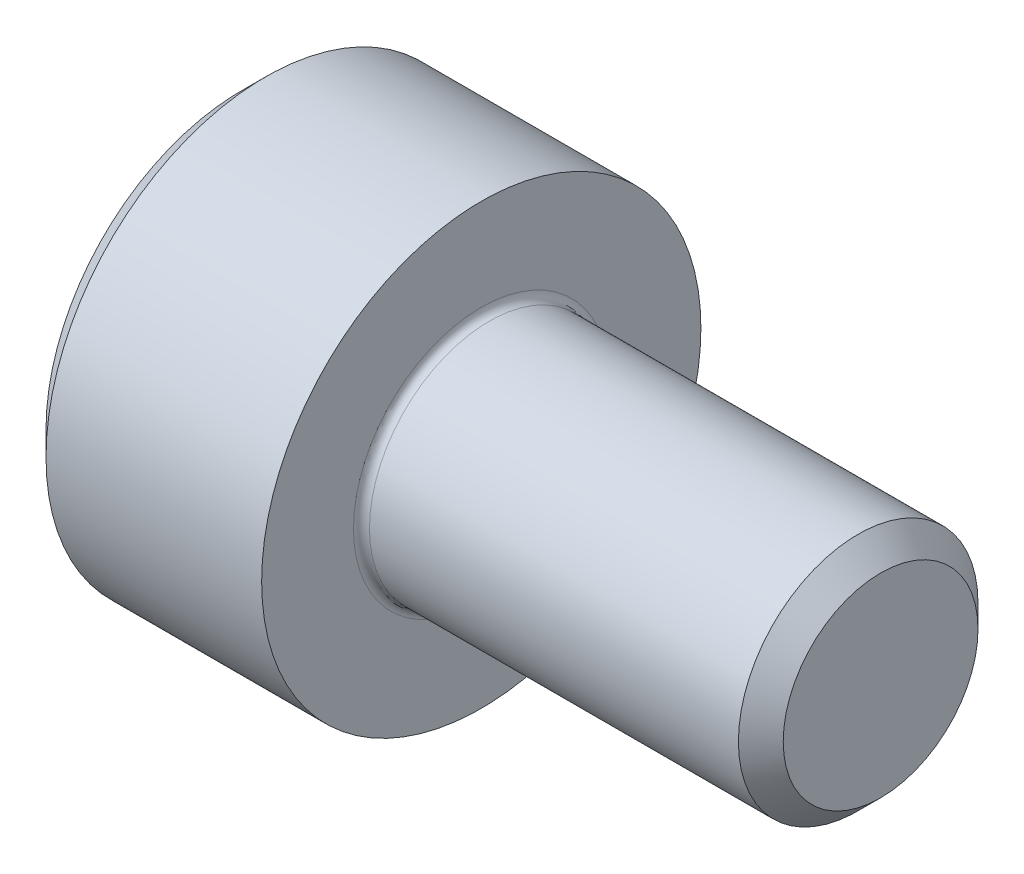
ISO-10303-21;
HEADER;
FILE_DESCRIPTION(('STEP AP214'),'2;1');
FILE_NAME('part.step','',(''),(''),'','','');
FILE_SCHEMA(('AUTOMOTIVE_DESIGN { 1 0 10303 214 1 1 1 1 }'));
ENDSEC;
DATA;
#1=APPLICATION_CONTEXT('core data for automotive mechanical design processes');
#2=APPLICATION_PROTOCOL_DEFINITION('international standard','automotive_design',2000,#1);
#3=PRODUCT_CONTEXT('',#1,'mechanical');
#4=PRODUCT('Part','Part','',(#3));
#5=PRODUCT_RELATED_PRODUCT_CATEGORY('part','',(#4));
#6=PRODUCT_DEFINITION_FORMATION('','',#4);
#7=PRODUCT_DEFINITION_CONTEXT('part definition',#1,'design');
#8=PRODUCT_DEFINITION('design','',#6,#7);
#9=PRODUCT_DEFINITION_SHAPE('','',#8);
#10=(LENGTH_UNIT() NAMED_UNIT(*) SI_UNIT(.MILLI.,.METRE.));
#11=(NAMED_UNIT(*) PLANE_ANGLE_UNIT() SI_UNIT($,.RADIAN.));
#12=(NAMED_UNIT(*) SI_UNIT($,.STERADIAN.) SOLID_ANGLE_UNIT());
#13=UNCERTAINTY_MEASURE_WITH_UNIT(LENGTH_MEASURE(1.E-05),#10,'distance_accuracy_value','');
#14=(GEOMETRIC_REPRESENTATION_CONTEXT(3) GLOBAL_UNCERTAINTY_ASSIGNED_CONTEXT((#13)) GLOBAL_UNIT_ASSIGNED_CONTEXT((#10,
#11,#12)) REPRESENTATION_CONTEXT('',''));
#15=CARTESIAN_POINT('',(0.,0.,0.));
#16=DIRECTION('',(0.,0.,1.));
#17=DIRECTION('',(1.,0.,0.));
#18=AXIS2_PLACEMENT_3D('',#15,#16,#17);
#19=CARTESIAN_POINT('',(0.,0.,0.));
#20=DIRECTION('',(-1.,0.,0.));
#21=DIRECTION('',(0.,0.,1.));
#22=AXIS2_PLACEMENT_3D('',#19,#20,#21);
#23=PLANE('',#22);
#24=DIRECTION('',(0.,-0.499999999999998,0.86602540378444));
#25=VECTOR('',#24,1.);
#26=CARTESIAN_POINT('',(0.,1.47801668912544,0.));
#27=LINE('',#26,#25);
#28=CARTESIAN_POINT('',(0.,1.47801668912544,0.));
#29=VERTEX_POINT('',#28);
#30=CARTESIAN_POINT('',(0.,0.73900834456272,1.28));
#31=VERTEX_POINT('',#30);
#32=EDGE_CURVE('E391',#29,#31,#27,.T.);
#33=ORIENTED_EDGE('',*,*,#32,.T.);
#34=DIRECTION('',(0.,1.,0.));
#35=VECTOR('',#34,1.);
#36=CARTESIAN_POINT('',(0.,-0.739008344562723,1.28));
#37=LINE('',#36,#35);
#38=CARTESIAN_POINT('',(0.,-0.739008344562723,1.28));
#39=VERTEX_POINT('',#38);
#40=EDGE_CURVE('E135',#39,#31,#37,.T.);
#41=ORIENTED_EDGE('',*,*,#40,.F.);
#42=DIRECTION('',(0.,-0.500000000000001,-0.866025403784438));
#43=VECTOR('',#42,1.);
#44=CARTESIAN_POINT('',(0.,-0.739008344562723,1.28));
#45=LINE('',#44,#43);
#46=CARTESIAN_POINT('',(0.,-1.47801668912545,0.));
#47=VERTEX_POINT('',#46);
#48=EDGE_CURVE('E394',#39,#47,#45,.T.);
#49=ORIENTED_EDGE('',*,*,#48,.T.);
#50=DIRECTION('',(0.,0.499999999999998,-0.866025403784439));
#51=VECTOR('',#50,1.);
#52=CARTESIAN_POINT('',(0.,-1.47801668912545,0.));
#53=LINE('',#52,#51);
#54=CARTESIAN_POINT('',(0.,-0.739008344562727,-1.28));
#55=VERTEX_POINT('',#54);
#56=EDGE_CURVE('E397',#47,#55,#53,.T.);
#57=ORIENTED_EDGE('',*,*,#56,.T.);
#58=DIRECTION('',(0.,-1.,0.));
#59=VECTOR('',#58,1.);
#60=CARTESIAN_POINT('',(0.,0.739008344562715,-1.28));
#61=LINE('',#60,#59);
#62=CARTESIAN_POINT('',(0.,0.739008344562715,-1.28));
#63=VERTEX_POINT('',#62);
#64=EDGE_CURVE('E400',#63,#55,#61,.T.);
#65=ORIENTED_EDGE('',*,*,#64,.F.);
#66=DIRECTION('',(0.,-0.500000000000001,-0.866025403784438));
#67=VECTOR('',#66,1.);
#68=CARTESIAN_POINT('',(0.,1.47801668912544,0.));
#69=LINE('',#68,#67);
#70=EDGE_CURVE('E130',#29,#63,#69,.T.);
#71=ORIENTED_EDGE('',*,*,#70,.F.);
#72=EDGE_LOOP('',(#33,#41,#49,#57,#65,#71));
#73=FACE_BOUND('',#72,.T.);
#74=CARTESIAN_POINT('',(0.,0.,0.));
#75=DIRECTION('',(-1.,0.,0.));
#76=DIRECTION('',(0.,0.,1.));
#77=AXIS2_PLACEMENT_3D('',#74,#75,#76);
#78=CIRCLE('',#77,2.45);
#79=CARTESIAN_POINT('',(0.,0.,2.45));
#80=VERTEX_POINT('',#79);
#81=EDGE_CURVE('E146',#80,#80,#78,.T.);
#82=ORIENTED_EDGE('',*,*,#81,.T.);
#83=EDGE_LOOP('',(#82));
#84=FACE_BOUND('',#83,.T.);
#85=ADVANCED_FACE('F39',(#73,#84),#23,.T.);
#86=CARTESIAN_POINT('',(8.,1.2195,0.));
#87=DIRECTION('',(1.,0.,0.));
#88=DIRECTION('',(0.,0.,-1.));
#89=AXIS2_PLACEMENT_3D('',#86,#87,#88);
#90=PLANE('',#89);
#91=CARTESIAN_POINT('',(8.,0.,0.));
#92=DIRECTION('',(-1.,0.,0.));
#93=DIRECTION('',(0.,0.,1.));
#94=AXIS2_PLACEMENT_3D('',#91,#92,#93);
#95=CIRCLE('',#94,1.2195);
#96=CARTESIAN_POINT('',(8.,0.,1.2195));
#97=VERTEX_POINT('',#96);
#98=EDGE_CURVE('E159',#97,#97,#95,.T.);
#99=ORIENTED_EDGE('',*,*,#98,.F.);
#100=EDGE_LOOP('',(#99));
#101=FACE_BOUND('',#100,.T.);
#102=ADVANCED_FACE('F180',(#101),#90,.T.);
#103=CARTESIAN_POINT('',(8.,0.,0.));
#104=DIRECTION('',(-1.,0.,0.));
#105=DIRECTION('',(0.,0.,1.));
#106=AXIS2_PLACEMENT_3D('',#103,#104,#105);
#107=CONICAL_SURFACE('',#106,1.2195,0.785398163397091);
#108=CARTESIAN_POINT('',(7.71949999999991,0.,0.));
#109=DIRECTION('',(-1.,0.,0.));
#110=DIRECTION('',(0.,0.,1.));
#111=AXIS2_PLACEMENT_3D('',#108,#109,#110);
#112=CIRCLE('',#111,1.49999999999989);
#113=CARTESIAN_POINT('',(7.71949999999991,0.,1.49999999999989));
#114=VERTEX_POINT('',#113);
#115=EDGE_CURVE('E156',#114,#114,#112,.T.);
#116=ORIENTED_EDGE('',*,*,#115,.F.);
#117=EDGE_LOOP('',(#116));
#118=FACE_BOUND('',#117,.T.);
#119=ORIENTED_EDGE('',*,*,#98,.T.);
#120=EDGE_LOOP('',(#119));
#121=FACE_BOUND('',#120,.T.);
#122=ADVANCED_FACE('F186',(#118,#121),#107,.T.);
#123=CARTESIAN_POINT('',(-31.75,0.,0.));
#124=DIRECTION('',(-1.,0.,0.));
#125=DIRECTION('',(0.,0.,1.));
#126=AXIS2_PLACEMENT_3D('',#123,#124,#125);
#127=CYLINDRICAL_SURFACE('',#126,1.49999999999995);
#128=CARTESIAN_POINT('',(3.1,0.,0.));
#129=DIRECTION('',(1.,0.,0.));
#130=DIRECTION('',(0.,0.,-1.));
#131=AXIS2_PLACEMENT_3D('',#128,#129,#130);
#132=CIRCLE('',#131,1.49999999999995);
#133=CARTESIAN_POINT('',(3.1,0.,-1.49999999999995));
#134=VERTEX_POINT('',#133);
#135=EDGE_CURVE('E11',#134,#134,#132,.T.);
#136=ORIENTED_EDGE('',*,*,#135,.T.);
#137=EDGE_LOOP('',(#136));
#138=FACE_BOUND('',#137,.T.);
#139=ORIENTED_EDGE('',*,*,#115,.T.);
#140=EDGE_LOOP('',(#139));
#141=FACE_BOUND('',#140,.T.);
#142=ADVANCED_FACE('F197',(#138,#141),#127,.T.);
#143=CARTESIAN_POINT('',(3.,2.75,0.));
#144=DIRECTION('',(1.,0.,0.));
#145=DIRECTION('',(0.,0.,-1.));
#146=AXIS2_PLACEMENT_3D('',#143,#144,#145);
#147=PLANE('',#146);
#148=CARTESIAN_POINT('',(3.,0.,0.));
#149=DIRECTION('',(1.,0.,0.));
#150=DIRECTION('',(0.,0.,-1.));
#151=AXIS2_PLACEMENT_3D('',#148,#149,#150);
#152=CIRCLE('',#151,1.59999999999995);
#153=CARTESIAN_POINT('',(3.,0.,-1.59999999999995));
#154=VERTEX_POINT('',#153);
#155=EDGE_CURVE('E47',#154,#154,#152,.F.);
#156=ORIENTED_EDGE('',*,*,#155,.T.);
#157=EDGE_LOOP('',(#156));
#158=FACE_BOUND('',#157,.T.);
#159=CARTESIAN_POINT('',(3.,0.,0.));
#160=DIRECTION('',(-1.,0.,0.));
#161=DIRECTION('',(0.,0.,1.));
#162=AXIS2_PLACEMENT_3D('',#159,#160,#161);
#163=CIRCLE('',#162,2.75);
#164=CARTESIAN_POINT('',(3.,0.,2.75));
#165=VERTEX_POINT('',#164);
#166=EDGE_CURVE('E153',#165,#165,#163,.T.);
#167=ORIENTED_EDGE('',*,*,#166,.F.);
#168=EDGE_LOOP('',(#167));
#169=FACE_BOUND('',#168,.T.);
#170=ADVANCED_FACE('F164',(#158,#169),#147,.T.);
#171=CARTESIAN_POINT('',(-31.75,0.,0.));
#172=DIRECTION('',(-1.,0.,0.));
#173=DIRECTION('',(0.,0.,1.));
#174=AXIS2_PLACEMENT_3D('',#171,#172,#173);
#175=CYLINDRICAL_SURFACE('',#174,2.75);
#176=ORIENTED_EDGE('',*,*,#166,.T.);
#177=EDGE_LOOP('',(#176));
#178=FACE_BOUND('',#177,.T.);
#179=CARTESIAN_POINT('',(0.300000000000002,0.,0.));
#180=DIRECTION('',(-1.,0.,0.));
#181=DIRECTION('',(0.,0.,1.));
#182=AXIS2_PLACEMENT_3D('',#179,#180,#181);
#183=CIRCLE('',#182,2.75);
#184=CARTESIAN_POINT('',(0.300000000000002,0.,2.75));
#185=VERTEX_POINT('',#184);
#186=EDGE_CURVE('E150',#185,#185,#183,.T.);
#187=ORIENTED_EDGE('',*,*,#186,.F.);
#188=EDGE_LOOP('',(#187));
#189=FACE_BOUND('',#188,.T.);
#190=ADVANCED_FACE('F175',(#178,#189),#175,.T.);
#191=CARTESIAN_POINT('',(0.,0.,0.));
#192=DIRECTION('',(1.,0.,0.));
#193=DIRECTION('',(0.,0.,-1.));
#194=AXIS2_PLACEMENT_3D('',#191,#192,#193);
#195=CONICAL_SURFACE('',#194,2.45,0.785398163397441);
#196=ORIENTED_EDGE('',*,*,#186,.T.);
#197=EDGE_LOOP('',(#196));
#198=FACE_BOUND('',#197,.T.);
#199=ORIENTED_EDGE('',*,*,#81,.F.);
#200=EDGE_LOOP('',(#199));
#201=FACE_BOUND('',#200,.T.);
#202=ADVANCED_FACE('F168',(#198,#201),#195,.T.);
#203=CARTESIAN_POINT('',(3.1,0.,0.));
#204=DIRECTION('',(1.,0.,0.));
#205=DIRECTION('',(0.,0.,-1.));
#206=AXIS2_PLACEMENT_3D('',#203,#204,#205);
#207=TOROIDAL_SURFACE('',#206,1.59999999999995,0.1);
#208=ORIENTED_EDGE('',*,*,#135,.F.);
#209=EDGE_LOOP('',(#208));
#210=FACE_BOUND('',#209,.T.);
#211=ORIENTED_EDGE('',*,*,#155,.F.);
#212=EDGE_LOOP('',(#211));
#213=FACE_BOUND('',#212,.T.);
#214=ADVANCED_FACE('F41',(#210,#213),#207,.F.);
#215=CARTESIAN_POINT('',(1.3,1.47801668912544,0.));
#216=DIRECTION('',(0.,-0.86602540378444,-0.499999999999998));
#217=DIRECTION('',(0.,0.499999999999998,-0.86602540378444));
#218=AXIS2_PLACEMENT_3D('',#215,#216,#217);
#219=PLANE('',#218);
#220=ORIENTED_EDGE('',*,*,#32,.F.);
#221=DIRECTION('',(-1.,0.,0.));
#222=VECTOR('',#221,1.);
#223=CARTESIAN_POINT('',(1.3,1.47801668912544,0.));
#224=LINE('',#223,#222);
#225=CARTESIAN_POINT('',(1.3,1.47801668912544,0.));
#226=VERTEX_POINT('',#225);
#227=EDGE_CURVE('E381',#226,#29,#224,.T.);
#228=ORIENTED_EDGE('',*,*,#227,.F.);
#229=DIRECTION('',(0.,-0.499999999999998,0.86602540378444));
#230=VECTOR('',#229,1.);
#231=CARTESIAN_POINT('',(1.3,1.47801668912544,0.));
#232=LINE('',#231,#230);
#233=CARTESIAN_POINT('',(1.3,1.10851251684408,0.639999999999996));
#234=VERTEX_POINT('',#233);
#235=EDGE_CURVE('E122',#226,#234,#232,.T.);
#236=ORIENTED_EDGE('',*,*,#235,.T.);
#237=CARTESIAN_POINT('',(1.3,0.73900834456272,1.28));
#238=VERTEX_POINT('',#237);
#239=EDGE_CURVE('E113',#234,#238,#232,.T.);
#240=ORIENTED_EDGE('',*,*,#239,.T.);
#241=DIRECTION('',(-1.,0.,0.));
#242=VECTOR('',#241,1.);
#243=CARTESIAN_POINT('',(1.3,0.73900834456272,1.28));
#244=LINE('',#243,#242);
#245=EDGE_CURVE('E127',#238,#31,#244,.T.);
#246=ORIENTED_EDGE('',*,*,#245,.T.);
#247=EDGE_LOOP('',(#220,#228,#236,#240,#246));
#248=FACE_BOUND('',#247,.T.);
#249=ADVANCED_FACE('F126',(#248),#219,.T.);
#250=CARTESIAN_POINT('',(1.3,-0.739008344562723,1.28));
#251=DIRECTION('',(0.,0.,1.));
#252=DIRECTION('',(0.,-1.,0.));
#253=AXIS2_PLACEMENT_3D('',#250,#251,#252);
#254=PLANE('',#253);
#255=ORIENTED_EDGE('',*,*,#40,.T.);
#256=ORIENTED_EDGE('',*,*,#245,.F.);
#257=DIRECTION('',(0.,1.,0.));
#258=VECTOR('',#257,1.);
#259=CARTESIAN_POINT('',(1.3,-0.739008344562723,1.28));
#260=LINE('',#259,#258);
#261=CARTESIAN_POINT('',(1.3,0.,1.28));
#262=VERTEX_POINT('',#261);
#263=EDGE_CURVE('E110',#262,#238,#260,.T.);
#264=ORIENTED_EDGE('',*,*,#263,.F.);
#265=CARTESIAN_POINT('',(1.3,-0.739008344562723,1.28));
#266=VERTEX_POINT('',#265);
#267=EDGE_CURVE('E121',#266,#262,#260,.T.);
#268=ORIENTED_EDGE('',*,*,#267,.F.);
#269=DIRECTION('',(-1.,0.,0.));
#270=VECTOR('',#269,1.);
#271=CARTESIAN_POINT('',(1.3,-0.739008344562723,1.28));
#272=LINE('',#271,#270);
#273=EDGE_CURVE('E137',#266,#39,#272,.T.);
#274=ORIENTED_EDGE('',*,*,#273,.T.);
#275=EDGE_LOOP('',(#255,#256,#264,#268,#274));
#276=FACE_BOUND('',#275,.T.);
#277=ADVANCED_FACE('F132',(#276),#254,.F.);
#278=CARTESIAN_POINT('',(1.3,-0.739008344562723,1.28));
#279=DIRECTION('',(0.,0.866025403784438,-0.500000000000001));
#280=DIRECTION('',(0.,0.500000000000001,0.866025403784438));
#281=AXIS2_PLACEMENT_3D('',#278,#279,#280);
#282=PLANE('',#281);
#283=ORIENTED_EDGE('',*,*,#48,.F.);
#284=ORIENTED_EDGE('',*,*,#273,.F.);
#285=DIRECTION('',(0.,-0.500000000000001,-0.866025403784438));
#286=VECTOR('',#285,1.);
#287=CARTESIAN_POINT('',(1.3,-0.739008344562723,1.28));
#288=LINE('',#287,#286);
#289=CARTESIAN_POINT('',(1.3,-1.10851251684408,0.640000000000003));
#290=VERTEX_POINT('',#289);
#291=EDGE_CURVE('E420',#266,#290,#288,.T.);
#292=ORIENTED_EDGE('',*,*,#291,.T.);
#293=CARTESIAN_POINT('',(1.3,-1.47801668912545,0.));
#294=VERTEX_POINT('',#293);
#295=EDGE_CURVE('E409',#290,#294,#288,.T.);
#296=ORIENTED_EDGE('',*,*,#295,.T.);
#297=DIRECTION('',(-1.,0.,0.));
#298=VECTOR('',#297,1.);
#299=CARTESIAN_POINT('',(1.3,-1.47801668912545,0.));
#300=LINE('',#299,#298);
#301=EDGE_CURVE('E142',#294,#47,#300,.T.);
#302=ORIENTED_EDGE('',*,*,#301,.T.);
#303=EDGE_LOOP('',(#283,#284,#292,#296,#302));
#304=FACE_BOUND('',#303,.T.);
#305=ADVANCED_FACE('F272',(#304),#282,.T.);
#306=CARTESIAN_POINT('',(1.3,-1.47801668912545,0.));
#307=DIRECTION('',(0.,0.86602540378444,0.499999999999998));
#308=DIRECTION('',(0.,-0.499999999999998,0.86602540378444));
#309=AXIS2_PLACEMENT_3D('',#306,#307,#308);
#310=PLANE('',#309);
#311=ORIENTED_EDGE('',*,*,#56,.F.);
#312=ORIENTED_EDGE('',*,*,#301,.F.);
#313=DIRECTION('',(0.,0.499999999999998,-0.866025403784439));
#314=VECTOR('',#313,1.);
#315=CARTESIAN_POINT('',(1.3,-1.47801668912545,0.));
#316=LINE('',#315,#314);
#317=CARTESIAN_POINT('',(1.3,-1.10851251684409,-0.64));
#318=VERTEX_POINT('',#317);
#319=EDGE_CURVE('E387',#294,#318,#316,.T.);
#320=ORIENTED_EDGE('',*,*,#319,.T.);
#321=CARTESIAN_POINT('',(1.3,-0.739008344562727,-1.28));
#322=VERTEX_POINT('',#321);
#323=EDGE_CURVE('E419',#318,#322,#316,.T.);
#324=ORIENTED_EDGE('',*,*,#323,.T.);
#325=DIRECTION('',(-1.,0.,0.));
#326=VECTOR('',#325,1.);
#327=CARTESIAN_POINT('',(1.3,-0.739008344562727,-1.28));
#328=LINE('',#327,#326);
#329=EDGE_CURVE('E380',#322,#55,#328,.T.);
#330=ORIENTED_EDGE('',*,*,#329,.T.);
#331=EDGE_LOOP('',(#311,#312,#320,#324,#330));
#332=FACE_BOUND('',#331,.T.);
#333=ADVANCED_FACE('F280',(#332),#310,.T.);
#334=CARTESIAN_POINT('',(1.3,0.739008344562715,-1.28));
#335=DIRECTION('',(0.,0.,-1.));
#336=DIRECTION('',(0.,1.,0.));
#337=AXIS2_PLACEMENT_3D('',#334,#335,#336);
#338=PLANE('',#337);
#339=ORIENTED_EDGE('',*,*,#64,.T.);
#340=ORIENTED_EDGE('',*,*,#329,.F.);
#341=DIRECTION('',(0.,-1.,0.));
#342=VECTOR('',#341,1.);
#343=CARTESIAN_POINT('',(1.3,0.739008344562715,-1.28));
#344=LINE('',#343,#342);
#345=CARTESIAN_POINT('',(1.3,0.,-1.28));
#346=VERTEX_POINT('',#345);
#347=EDGE_CURVE('E384',#346,#322,#344,.T.);
#348=ORIENTED_EDGE('',*,*,#347,.F.);
#349=CARTESIAN_POINT('',(1.3,0.739008344562715,-1.28));
#350=VERTEX_POINT('',#349);
#351=EDGE_CURVE('E54',#350,#346,#344,.T.);
#352=ORIENTED_EDGE('',*,*,#351,.F.);
#353=DIRECTION('',(-1.,0.,0.));
#354=VECTOR('',#353,1.);
#355=CARTESIAN_POINT('',(1.3,0.739008344562715,-1.28));
#356=LINE('',#355,#354);
#357=EDGE_CURVE('E377',#350,#63,#356,.T.);
#358=ORIENTED_EDGE('',*,*,#357,.T.);
#359=EDGE_LOOP('',(#339,#340,#348,#352,#358));
#360=FACE_BOUND('',#359,.T.);
#361=ADVANCED_FACE('F289',(#360),#338,.F.);
#362=CARTESIAN_POINT('',(1.3,1.47801668912544,0.));
#363=DIRECTION('',(0.,0.866025403784438,-0.500000000000001));
#364=DIRECTION('',(0.,0.500000000000001,0.866025403784438));
#365=AXIS2_PLACEMENT_3D('',#362,#363,#364);
#366=PLANE('',#365);
#367=ORIENTED_EDGE('',*,*,#70,.T.);
#368=ORIENTED_EDGE('',*,*,#357,.F.);
#369=DIRECTION('',(0.,-0.500000000000001,-0.866025403784438));
#370=VECTOR('',#369,1.);
#371=CARTESIAN_POINT('',(1.3,1.47801668912544,0.));
#372=LINE('',#371,#370);
#373=CARTESIAN_POINT('',(1.3,1.10851251684408,-0.64));
#374=VERTEX_POINT('',#373);
#375=EDGE_CURVE('E367',#374,#350,#372,.T.);
#376=ORIENTED_EDGE('',*,*,#375,.F.);
#377=EDGE_CURVE('E373',#226,#374,#372,.T.);
#378=ORIENTED_EDGE('',*,*,#377,.F.);
#379=ORIENTED_EDGE('',*,*,#227,.T.);
#380=EDGE_LOOP('',(#367,#368,#376,#378,#379));
#381=FACE_BOUND('',#380,.T.);
#382=ADVANCED_FACE('F298',(#381),#366,.F.);
#383=CARTESIAN_POINT('',(1.3,2.21702503368816,-1.28000000000001));
#384=DIRECTION('',(1.,0.,0.));
#385=DIRECTION('',(0.,0.,-1.));
#386=AXIS2_PLACEMENT_3D('',#383,#384,#385);
#387=PLANE('',#386);
#388=ORIENTED_EDGE('',*,*,#347,.T.);
#389=ORIENTED_EDGE('',*,*,#323,.F.);
#390=CARTESIAN_POINT('',(1.3,0.,0.));
#391=DIRECTION('',(-1.,0.,0.));
#392=DIRECTION('',(0.,0.,1.));
#393=AXIS2_PLACEMENT_3D('',#390,#391,#392);
#394=CIRCLE('',#393,1.28);
#395=EDGE_CURVE('E415',#346,#318,#394,.T.);
#396=ORIENTED_EDGE('',*,*,#395,.F.);
#397=EDGE_LOOP('',(#388,#389,#396));
#398=FACE_BOUND('',#397,.T.);
#399=ADVANCED_FACE('F307',(#398),#387,.F.);
#400=ORIENTED_EDGE('',*,*,#319,.F.);
#401=ORIENTED_EDGE('',*,*,#295,.F.);
#402=EDGE_CURVE('E140',#318,#290,#394,.T.);
#403=ORIENTED_EDGE('',*,*,#402,.F.);
#404=EDGE_LOOP('',(#400,#401,#403));
#405=FACE_BOUND('',#404,.T.);
#406=ADVANCED_FACE('F316',(#405),#387,.F.);
#407=ORIENTED_EDGE('',*,*,#291,.F.);
#408=ORIENTED_EDGE('',*,*,#267,.T.);
#409=EDGE_CURVE('E136',#290,#262,#394,.T.);
#410=ORIENTED_EDGE('',*,*,#409,.F.);
#411=EDGE_LOOP('',(#407,#408,#410));
#412=FACE_BOUND('',#411,.T.);
#413=ADVANCED_FACE('F325',(#412),#387,.F.);
#414=ORIENTED_EDGE('',*,*,#263,.T.);
#415=ORIENTED_EDGE('',*,*,#239,.F.);
#416=EDGE_CURVE('E116',#262,#234,#394,.T.);
#417=ORIENTED_EDGE('',*,*,#416,.F.);
#418=EDGE_LOOP('',(#414,#415,#417));
#419=FACE_BOUND('',#418,.T.);
#420=ADVANCED_FACE('F112',(#419),#387,.F.);
#421=ORIENTED_EDGE('',*,*,#235,.F.);
#422=ORIENTED_EDGE('',*,*,#377,.T.);
#423=EDGE_CURVE('E147',#234,#374,#394,.T.);
#424=ORIENTED_EDGE('',*,*,#423,.F.);
#425=EDGE_LOOP('',(#421,#422,#424));
#426=FACE_BOUND('',#425,.T.);
#427=ADVANCED_FACE('F340',(#426),#387,.F.);
#428=ORIENTED_EDGE('',*,*,#375,.T.);
#429=ORIENTED_EDGE('',*,*,#351,.T.);
#430=EDGE_CURVE('E370',#374,#346,#394,.T.);
#431=ORIENTED_EDGE('',*,*,#430,.F.);
#432=EDGE_LOOP('',(#428,#429,#431));
#433=FACE_BOUND('',#432,.T.);
#434=ADVANCED_FACE('F255',(#433),#387,.F.);
#435=CARTESIAN_POINT('',(1.3,0.,0.));
#436=DIRECTION('',(-1.,0.,0.));
#437=DIRECTION('',(0.,0.,1.));
#438=AXIS2_PLACEMENT_3D('',#435,#436,#437);
#439=CONICAL_SURFACE('',#438,1.28,1.0471975511966);
#440=CARTESIAN_POINT('',(2.03900834456273,0.,0.));
#441=VERTEX_POINT('',#440);
#442=VERTEX_LOOP('',#441);
#443=FACE_BOUND('',#442,.T.);
#444=ORIENTED_EDGE('',*,*,#416,.T.);
#445=ORIENTED_EDGE('',*,*,#423,.T.);
#446=ORIENTED_EDGE('',*,*,#430,.T.);
#447=ORIENTED_EDGE('',*,*,#395,.T.);
#448=ORIENTED_EDGE('',*,*,#402,.T.);
#449=ORIENTED_EDGE('',*,*,#409,.T.);
#450=EDGE_LOOP('',(#444,#445,#446,#447,#448,#449));
#451=FACE_BOUND('',#450,.T.);
#452=ADVANCED_FACE('F190',(#443,#451),#439,.F.);
#453=CLOSED_SHELL('',(#85,#102,#122,#142,#170,#190,#202,#214,#249,#277,#305,#333,#361,#382,#399,
#406,#413,#420,#427,#434,#452));
#454=MANIFOLD_SOLID_BREP('B2',#453);
#455=ADVANCED_BREP_SHAPE_REPRESENTATION('',(#18,#454),#14);
#456=SHAPE_DEFINITION_REPRESENTATION(#9,#455);
ENDSEC;
END-ISO-10303-21;
